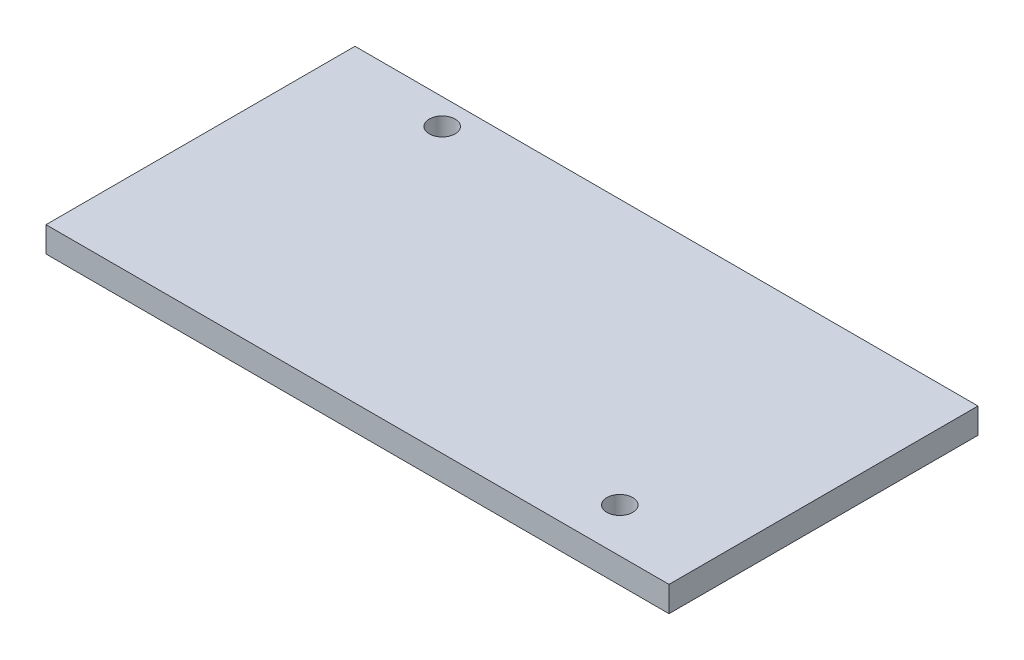
ISO-10303-21;
HEADER;
FILE_DESCRIPTION(('STEP AP214'),'2;1');
FILE_NAME('part.step','',(''),(''),'','','');
FILE_SCHEMA(('AUTOMOTIVE_DESIGN { 1 0 10303 214 1 1 1 1 }'));
ENDSEC;
DATA;
#1=APPLICATION_CONTEXT('core data for automotive mechanical design processes');
#2=APPLICATION_PROTOCOL_DEFINITION('international standard','automotive_design',2000,#1);
#3=PRODUCT_CONTEXT('',#1,'mechanical');
#4=PRODUCT('Part','Part','',(#3));
#5=PRODUCT_RELATED_PRODUCT_CATEGORY('part','',(#4));
#6=PRODUCT_DEFINITION_FORMATION('','',#4);
#7=PRODUCT_DEFINITION_CONTEXT('part definition',#1,'design');
#8=PRODUCT_DEFINITION('design','',#6,#7);
#9=PRODUCT_DEFINITION_SHAPE('','',#8);
#10=(LENGTH_UNIT() NAMED_UNIT(*) SI_UNIT(.MILLI.,.METRE.));
#11=(NAMED_UNIT(*) PLANE_ANGLE_UNIT() SI_UNIT($,.RADIAN.));
#12=(NAMED_UNIT(*) SI_UNIT($,.STERADIAN.) SOLID_ANGLE_UNIT());
#13=UNCERTAINTY_MEASURE_WITH_UNIT(LENGTH_MEASURE(1.E-05),#10,'distance_accuracy_value','');
#14=(GEOMETRIC_REPRESENTATION_CONTEXT(3) GLOBAL_UNCERTAINTY_ASSIGNED_CONTEXT((#13)) GLOBAL_UNIT_ASSIGNED_CONTEXT((#10,
#11,#12)) REPRESENTATION_CONTEXT('',''));
#15=CARTESIAN_POINT('',(0.,0.,0.));
#16=DIRECTION('',(0.,0.,1.));
#17=DIRECTION('',(1.,0.,0.));
#18=AXIS2_PLACEMENT_3D('',#15,#16,#17);
#19=CARTESIAN_POINT('',(0.,2.,0.));
#20=DIRECTION('',(1.,0.,0.));
#21=DIRECTION('',(0.,0.,-1.));
#22=AXIS2_PLACEMENT_3D('',#19,#20,#21);
#23=PLANE('',#22);
#24=DIRECTION('',(0.,0.,1.));
#25=VECTOR('',#24,1.);
#26=CARTESIAN_POINT('',(0.,0.,0.));
#27=LINE('',#26,#25);
#28=CARTESIAN_POINT('',(0.,0.,0.));
#29=VERTEX_POINT('',#28);
#30=CARTESIAN_POINT('',(0.,0.,24.3));
#31=VERTEX_POINT('',#30);
#32=EDGE_CURVE('E96',#29,#31,#27,.T.);
#33=ORIENTED_EDGE('',*,*,#32,.T.);
#34=DIRECTION('',(0.,-1.,0.));
#35=VECTOR('',#34,1.);
#36=CARTESIAN_POINT('',(0.,2.,24.3));
#37=LINE('',#36,#35);
#38=CARTESIAN_POINT('',(0.,2.,24.3));
#39=VERTEX_POINT('',#38);
#40=EDGE_CURVE('E11',#39,#31,#37,.T.);
#41=ORIENTED_EDGE('',*,*,#40,.F.);
#42=DIRECTION('',(0.,0.,1.));
#43=VECTOR('',#42,1.);
#44=CARTESIAN_POINT('',(0.,2.,0.));
#45=LINE('',#44,#43);
#46=CARTESIAN_POINT('',(0.,2.,0.));
#47=VERTEX_POINT('',#46);
#48=EDGE_CURVE('E84',#47,#39,#45,.T.);
#49=ORIENTED_EDGE('',*,*,#48,.F.);
#50=DIRECTION('',(0.,-1.,0.));
#51=VECTOR('',#50,1.);
#52=CARTESIAN_POINT('',(0.,2.,0.));
#53=LINE('',#52,#51);
#54=EDGE_CURVE('E92',#47,#29,#53,.T.);
#55=ORIENTED_EDGE('',*,*,#54,.T.);
#56=EDGE_LOOP('',(#33,#41,#49,#55));
#57=FACE_BOUND('',#56,.T.);
#58=ADVANCED_FACE('F33',(#57),#23,.F.);
#59=CARTESIAN_POINT('',(0.,2.,24.3));
#60=DIRECTION('',(0.,0.,-1.));
#61=DIRECTION('',(-1.,0.,0.));
#62=AXIS2_PLACEMENT_3D('',#59,#60,#61);
#63=PLANE('',#62);
#64=DIRECTION('',(1.,0.,0.));
#65=VECTOR('',#64,1.);
#66=CARTESIAN_POINT('',(0.,0.,24.3));
#67=LINE('',#66,#65);
#68=CARTESIAN_POINT('',(49.,0.,24.3));
#69=VERTEX_POINT('',#68);
#70=EDGE_CURVE('E88',#31,#69,#67,.T.);
#71=ORIENTED_EDGE('',*,*,#70,.T.);
#72=DIRECTION('',(0.,-1.,0.));
#73=VECTOR('',#72,1.);
#74=CARTESIAN_POINT('',(49.,2.,24.3));
#75=LINE('',#74,#73);
#76=CARTESIAN_POINT('',(49.,2.,24.3));
#77=VERTEX_POINT('',#76);
#78=EDGE_CURVE('E41',#77,#69,#75,.T.);
#79=ORIENTED_EDGE('',*,*,#78,.F.);
#80=DIRECTION('',(1.,0.,0.));
#81=VECTOR('',#80,1.);
#82=CARTESIAN_POINT('',(0.,2.,24.3));
#83=LINE('',#82,#81);
#84=EDGE_CURVE('E79',#39,#77,#83,.T.);
#85=ORIENTED_EDGE('',*,*,#84,.F.);
#86=ORIENTED_EDGE('',*,*,#40,.T.);
#87=EDGE_LOOP('',(#71,#79,#85,#86));
#88=FACE_BOUND('',#87,.T.);
#89=ADVANCED_FACE('F87',(#88),#63,.F.);
#90=CARTESIAN_POINT('',(49.,2.,0.));
#91=DIRECTION('',(-1.,0.,0.));
#92=DIRECTION('',(0.,0.,1.));
#93=AXIS2_PLACEMENT_3D('',#90,#91,#92);
#94=PLANE('',#93);
#95=DIRECTION('',(0.,0.,-1.));
#96=VECTOR('',#95,1.);
#97=CARTESIAN_POINT('',(49.,0.,0.));
#98=LINE('',#97,#96);
#99=CARTESIAN_POINT('',(49.,0.,0.));
#100=VERTEX_POINT('',#99);
#101=EDGE_CURVE('E66',#69,#100,#98,.T.);
#102=ORIENTED_EDGE('',*,*,#101,.T.);
#103=DIRECTION('',(0.,-1.,0.));
#104=VECTOR('',#103,1.);
#105=CARTESIAN_POINT('',(49.,2.,0.));
#106=LINE('',#105,#104);
#107=CARTESIAN_POINT('',(49.,2.,0.));
#108=VERTEX_POINT('',#107);
#109=EDGE_CURVE('E89',#108,#100,#106,.T.);
#110=ORIENTED_EDGE('',*,*,#109,.F.);
#111=DIRECTION('',(0.,0.,-1.));
#112=VECTOR('',#111,1.);
#113=CARTESIAN_POINT('',(49.,2.,0.));
#114=LINE('',#113,#112);
#115=EDGE_CURVE('E82',#77,#108,#114,.T.);
#116=ORIENTED_EDGE('',*,*,#115,.F.);
#117=ORIENTED_EDGE('',*,*,#78,.T.);
#118=EDGE_LOOP('',(#102,#110,#116,#117));
#119=FACE_BOUND('',#118,.T.);
#120=ADVANCED_FACE('F90',(#119),#94,.F.);
#121=CARTESIAN_POINT('',(0.,2.,0.));
#122=DIRECTION('',(0.,0.,1.));
#123=DIRECTION('',(1.,0.,0.));
#124=AXIS2_PLACEMENT_3D('',#121,#122,#123);
#125=PLANE('',#124);
#126=DIRECTION('',(-1.,0.,0.));
#127=VECTOR('',#126,1.);
#128=CARTESIAN_POINT('',(0.,0.,0.));
#129=LINE('',#128,#127);
#130=EDGE_CURVE('E72',#100,#29,#129,.T.);
#131=ORIENTED_EDGE('',*,*,#130,.T.);
#132=ORIENTED_EDGE('',*,*,#54,.F.);
#133=DIRECTION('',(-1.,0.,0.));
#134=VECTOR('',#133,1.);
#135=CARTESIAN_POINT('',(0.,2.,0.));
#136=LINE('',#135,#134);
#137=EDGE_CURVE('E49',#108,#47,#136,.T.);
#138=ORIENTED_EDGE('',*,*,#137,.F.);
#139=ORIENTED_EDGE('',*,*,#109,.T.);
#140=EDGE_LOOP('',(#131,#132,#138,#139));
#141=FACE_BOUND('',#140,.T.);
#142=ADVANCED_FACE('F104',(#141),#125,.F.);
#143=CARTESIAN_POINT('',(0.,2.,0.));
#144=DIRECTION('',(0.,1.,0.));
#145=DIRECTION('',(0.,0.,1.));
#146=AXIS2_PLACEMENT_3D('',#143,#144,#145);
#147=PLANE('',#146);
#148=CARTESIAN_POINT('',(41.656,2.,20.828));
#149=DIRECTION('',(0.,1.,0.));
#150=DIRECTION('',(0.,0.,1.));
#151=AXIS2_PLACEMENT_3D('',#148,#149,#150);
#152=CIRCLE('',#151,1.015);
#153=CARTESIAN_POINT('',(41.656,2.,21.843));
#154=VERTEX_POINT('',#153);
#155=EDGE_CURVE('E116',#154,#154,#152,.T.);
#156=ORIENTED_EDGE('',*,*,#155,.F.);
#157=EDGE_LOOP('',(#156));
#158=FACE_BOUND('',#157,.T.);
#159=CARTESIAN_POINT('',(8.89,2.,2.032));
#160=DIRECTION('',(0.,1.,0.));
#161=DIRECTION('',(0.,0.,1.));
#162=AXIS2_PLACEMENT_3D('',#159,#160,#161);
#163=CIRCLE('',#162,1.015);
#164=CARTESIAN_POINT('',(8.89,2.,3.047));
#165=VERTEX_POINT('',#164);
#166=EDGE_CURVE('E110',#165,#165,#163,.T.);
#167=ORIENTED_EDGE('',*,*,#166,.F.);
#168=EDGE_LOOP('',(#167));
#169=FACE_BOUND('',#168,.T.);
#170=ORIENTED_EDGE('',*,*,#48,.T.);
#171=ORIENTED_EDGE('',*,*,#84,.T.);
#172=ORIENTED_EDGE('',*,*,#115,.T.);
#173=ORIENTED_EDGE('',*,*,#137,.T.);
#174=EDGE_LOOP('',(#170,#171,#172,#173));
#175=FACE_BOUND('',#174,.T.);
#176=ADVANCED_FACE('F80',(#158,#169,#175),#147,.T.);
#177=CARTESIAN_POINT('',(0.,0.,0.));
#178=DIRECTION('',(0.,1.,0.));
#179=DIRECTION('',(0.,0.,1.));
#180=AXIS2_PLACEMENT_3D('',#177,#178,#179);
#181=PLANE('',#180);
#182=CARTESIAN_POINT('',(41.656,0.,20.828));
#183=DIRECTION('',(0.,1.,0.));
#184=DIRECTION('',(0.,0.,1.));
#185=AXIS2_PLACEMENT_3D('',#182,#183,#184);
#186=CIRCLE('',#185,1.015);
#187=CARTESIAN_POINT('',(41.656,0.,21.843));
#188=VERTEX_POINT('',#187);
#189=EDGE_CURVE('E113',#188,#188,#186,.T.);
#190=ORIENTED_EDGE('',*,*,#189,.T.);
#191=EDGE_LOOP('',(#190));
#192=FACE_BOUND('',#191,.T.);
#193=CARTESIAN_POINT('',(8.89,0.,2.032));
#194=DIRECTION('',(0.,1.,0.));
#195=DIRECTION('',(0.,0.,1.));
#196=AXIS2_PLACEMENT_3D('',#193,#194,#195);
#197=CIRCLE('',#196,1.015);
#198=CARTESIAN_POINT('',(8.89,0.,3.047));
#199=VERTEX_POINT('',#198);
#200=EDGE_CURVE('E99',#199,#199,#197,.T.);
#201=ORIENTED_EDGE('',*,*,#200,.T.);
#202=EDGE_LOOP('',(#201));
#203=FACE_BOUND('',#202,.T.);
#204=ORIENTED_EDGE('',*,*,#32,.F.);
#205=ORIENTED_EDGE('',*,*,#130,.F.);
#206=ORIENTED_EDGE('',*,*,#101,.F.);
#207=ORIENTED_EDGE('',*,*,#70,.F.);
#208=EDGE_LOOP('',(#204,#205,#206,#207));
#209=FACE_BOUND('',#208,.T.);
#210=ADVANCED_FACE('F107',(#192,#203,#209),#181,.F.);
#211=CARTESIAN_POINT('',(8.89,0.,2.032));
#212=DIRECTION('',(0.,1.,0.));
#213=DIRECTION('',(0.,0.,1.));
#214=AXIS2_PLACEMENT_3D('',#211,#212,#213);
#215=CYLINDRICAL_SURFACE('',#214,1.015);
#216=ORIENTED_EDGE('',*,*,#200,.F.);
#217=EDGE_LOOP('',(#216));
#218=FACE_BOUND('',#217,.T.);
#219=ORIENTED_EDGE('',*,*,#166,.T.);
#220=EDGE_LOOP('',(#219));
#221=FACE_BOUND('',#220,.T.);
#222=ADVANCED_FACE('F127',(#218,#221),#215,.F.);
#223=CARTESIAN_POINT('',(41.656,0.,20.828));
#224=DIRECTION('',(0.,1.,0.));
#225=DIRECTION('',(0.,0.,1.));
#226=AXIS2_PLACEMENT_3D('',#223,#224,#225);
#227=CYLINDRICAL_SURFACE('',#226,1.015);
#228=ORIENTED_EDGE('',*,*,#189,.F.);
#229=EDGE_LOOP('',(#228));
#230=FACE_BOUND('',#229,.T.);
#231=ORIENTED_EDGE('',*,*,#155,.T.);
#232=EDGE_LOOP('',(#231));
#233=FACE_BOUND('',#232,.T.);
#234=ADVANCED_FACE('F124',(#230,#233),#227,.F.);
#235=CLOSED_SHELL('',(#58,#89,#120,#142,#176,#210,#222,#234));
#236=MANIFOLD_SOLID_BREP('B2',#235);
#237=ADVANCED_BREP_SHAPE_REPRESENTATION('',(#18,#236),#14);
#238=SHAPE_DEFINITION_REPRESENTATION(#9,#237);
ENDSEC;
END-ISO-10303-21;
